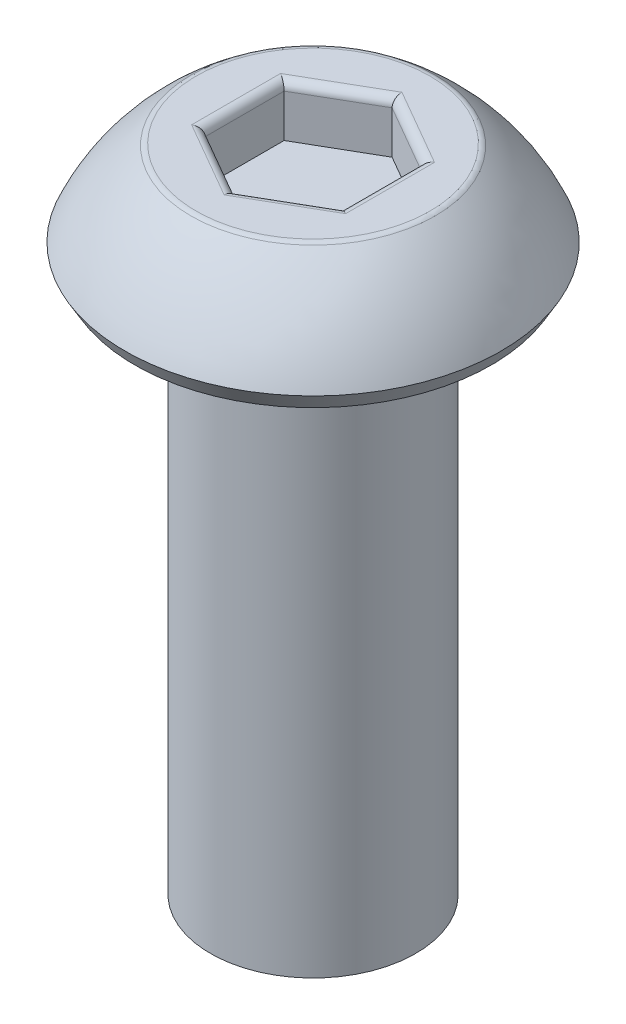
ISO-10303-21;
HEADER;
FILE_DESCRIPTION(('STEP AP214'),'2;1');
FILE_NAME('part.step','',(''),(''),'','','');
FILE_SCHEMA(('AUTOMOTIVE_DESIGN { 1 0 10303 214 1 1 1 1 }'));
ENDSEC;
DATA;
#1=APPLICATION_CONTEXT('core data for automotive mechanical design processes');
#2=APPLICATION_PROTOCOL_DEFINITION('international standard','automotive_design',2000,#1);
#3=PRODUCT_CONTEXT('',#1,'mechanical');
#4=PRODUCT('Part','Part','',(#3));
#5=PRODUCT_RELATED_PRODUCT_CATEGORY('part','',(#4));
#6=PRODUCT_DEFINITION_FORMATION('','',#4);
#7=PRODUCT_DEFINITION_CONTEXT('part definition',#1,'design');
#8=PRODUCT_DEFINITION('design','',#6,#7);
#9=PRODUCT_DEFINITION_SHAPE('','',#8);
#10=(LENGTH_UNIT() NAMED_UNIT(*) SI_UNIT(.MILLI.,.METRE.));
#11=(NAMED_UNIT(*) PLANE_ANGLE_UNIT() SI_UNIT($,.RADIAN.));
#12=(NAMED_UNIT(*) SI_UNIT($,.STERADIAN.) SOLID_ANGLE_UNIT());
#13=UNCERTAINTY_MEASURE_WITH_UNIT(LENGTH_MEASURE(1.E-05),#10,'distance_accuracy_value','');
#14=(GEOMETRIC_REPRESENTATION_CONTEXT(3) GLOBAL_UNCERTAINTY_ASSIGNED_CONTEXT((#13)) GLOBAL_UNIT_ASSIGNED_CONTEXT((#10,
#11,#12)) REPRESENTATION_CONTEXT('',''));
#15=CARTESIAN_POINT('',(0.,0.,0.));
#16=DIRECTION('',(0.,0.,1.));
#17=DIRECTION('',(1.,0.,0.));
#18=AXIS2_PLACEMENT_3D('',#15,#16,#17);
#19=CARTESIAN_POINT('',(0.,1.5,0.));
#20=DIRECTION('',(0.,-1.,0.));
#21=DIRECTION('',(0.,0.,-1.));
#22=AXIS2_PLACEMENT_3D('',#19,#20,#21);
#23=PLANE('',#22);
#24=CARTESIAN_POINT('',(0.,1.5,0.));
#25=DIRECTION('',(0.,-1.,0.));
#26=DIRECTION('',(0.,0.,-1.));
#27=AXIS2_PLACEMENT_3D('',#24,#25,#26);
#28=CIRCLE('',#27,1.70906948191647);
#29=CARTESIAN_POINT('',(0.,1.5,-1.70906948191647));
#30=VERTEX_POINT('',#29);
#31=EDGE_CURVE('E178',#30,#30,#28,.F.);
#32=ORIENTED_EDGE('',*,*,#31,.T.);
#33=EDGE_LOOP('',(#32));
#34=FACE_BOUND('',#33,.T.);
#35=DIRECTION('',(0.866025403784439,0.,-0.5));
#36=VECTOR('',#35,1.);
#37=CARTESIAN_POINT('',(0.5625,1.5,0.974278579257493));
#38=LINE('',#37,#36);
#39=CARTESIAN_POINT('',(1.125,1.5,0.649519052838329));
#40=VERTEX_POINT('',#39);
#41=CARTESIAN_POINT('',(0.,1.5,1.29903810567666));
#42=VERTEX_POINT('',#41);
#43=EDGE_CURVE('E173',#40,#42,#38,.F.);
#44=ORIENTED_EDGE('',*,*,#43,.T.);
#45=DIRECTION('',(0.866025403784439,0.,0.5));
#46=VECTOR('',#45,1.);
#47=CARTESIAN_POINT('',(-0.5625,1.5,0.974278579257493));
#48=LINE('',#47,#46);
#49=CARTESIAN_POINT('',(-1.125,1.5,0.649519052838329));
#50=VERTEX_POINT('',#49);
#51=EDGE_CURVE('E175',#42,#50,#48,.F.);
#52=ORIENTED_EDGE('',*,*,#51,.T.);
#53=DIRECTION('',(0.,0.,1.));
#54=VECTOR('',#53,1.);
#55=CARTESIAN_POINT('',(-1.125,1.5,0.));
#56=LINE('',#55,#54);
#57=CARTESIAN_POINT('',(-1.125,1.5,-0.649519052838329));
#58=VERTEX_POINT('',#57);
#59=EDGE_CURVE('E165',#50,#58,#56,.F.);
#60=ORIENTED_EDGE('',*,*,#59,.T.);
#61=DIRECTION('',(-0.866025403784439,0.,0.5));
#62=VECTOR('',#61,1.);
#63=CARTESIAN_POINT('',(-0.5625,1.5,-0.974278579257493));
#64=LINE('',#63,#62);
#65=CARTESIAN_POINT('',(0.,1.5,-1.29903810567666));
#66=VERTEX_POINT('',#65);
#67=EDGE_CURVE('E167',#58,#66,#64,.F.);
#68=ORIENTED_EDGE('',*,*,#67,.T.);
#69=DIRECTION('',(-0.866025403784439,0.,-0.5));
#70=VECTOR('',#69,1.);
#71=CARTESIAN_POINT('',(0.5625,1.5,-0.974278579257494));
#72=LINE('',#71,#70);
#73=CARTESIAN_POINT('',(1.125,1.5,-0.64951905283833));
#74=VERTEX_POINT('',#73);
#75=EDGE_CURVE('E169',#66,#74,#72,.F.);
#76=ORIENTED_EDGE('',*,*,#75,.T.);
#77=DIRECTION('',(0.,0.,-1.));
#78=VECTOR('',#77,1.);
#79=CARTESIAN_POINT('',(1.125,1.5,0.));
#80=LINE('',#79,#78);
#81=EDGE_CURVE('E171',#74,#40,#80,.F.);
#82=ORIENTED_EDGE('',*,*,#81,.T.);
#83=EDGE_LOOP('',(#44,#52,#60,#68,#76,#82));
#84=FACE_BOUND('',#83,.T.);
#85=ADVANCED_FACE('F36',(#34,#84),#23,.F.);
#86=CARTESIAN_POINT('',(0.,-0.931154789034212,0.));
#87=DIRECTION('',(0.,-1.,0.));
#88=DIRECTION('',(0.,0.,-1.));
#89=AXIS2_PLACEMENT_3D('',#86,#87,#88);
#90=DEGENERATE_TOROIDAL_SURFACE('',#89,0.00769348629276519,3.,.F.);
#91=CARTESIAN_POINT('',(0.,1.47526759952323,0.));
#92=DIRECTION('',(0.,-1.,0.));
#93=DIRECTION('',(0.,0.,-1.));
#94=AXIS2_PLACEMENT_3D('',#91,#92,#93);
#95=CIRCLE('',#94,1.78371135009948);
#96=CARTESIAN_POINT('',(0.,1.47526759952323,-1.78371135009948));
#97=VERTEX_POINT('',#96);
#98=EDGE_CURVE('E162',#97,#97,#95,.T.);
#99=ORIENTED_EDGE('',*,*,#98,.T.);
#100=EDGE_LOOP('',(#99));
#101=FACE_BOUND('',#100,.T.);
#102=CARTESIAN_POINT('',(0.,0.25,0.));
#103=DIRECTION('',(0.,-1.,0.));
#104=DIRECTION('',(0.,0.,-1.));
#105=AXIS2_PLACEMENT_3D('',#102,#103,#104);
#106=CIRCLE('',#105,2.75);
#107=CARTESIAN_POINT('',(0.,0.25,-2.75));
#108=VERTEX_POINT('',#107);
#109=EDGE_CURVE('E159',#108,#108,#106,.T.);
#110=ORIENTED_EDGE('',*,*,#109,.F.);
#111=EDGE_LOOP('',(#110));
#112=FACE_BOUND('',#111,.T.);
#113=ADVANCED_FACE('F245',(#101,#112),#90,.F.);
#114=CARTESIAN_POINT('',(0.,0.25,0.));
#115=DIRECTION('',(0.,1.,0.));
#116=DIRECTION('',(0.,0.,1.));
#117=AXIS2_PLACEMENT_3D('',#114,#115,#116);
#118=CONICAL_SURFACE('',#117,2.75,0.523598775598296);
#119=CARTESIAN_POINT('',(0.,0.,0.));
#120=DIRECTION('',(0.,-1.,0.));
#121=DIRECTION('',(0.,0.,-1.));
#122=AXIS2_PLACEMENT_3D('',#119,#120,#121);
#123=CIRCLE('',#122,2.60566243270259);
#124=CARTESIAN_POINT('',(0.,0.,-2.60566243270259));
#125=VERTEX_POINT('',#124);
#126=EDGE_CURVE('E156',#125,#125,#123,.T.);
#127=ORIENTED_EDGE('',*,*,#126,.F.);
#128=EDGE_LOOP('',(#127));
#129=FACE_BOUND('',#128,.T.);
#130=ORIENTED_EDGE('',*,*,#109,.T.);
#131=EDGE_LOOP('',(#130));
#132=FACE_BOUND('',#131,.T.);
#133=ADVANCED_FACE('F251',(#129,#132),#118,.T.);
#134=CARTESIAN_POINT('',(0.,0.,2.60566243270259));
#135=DIRECTION('',(0.,1.,0.));
#136=DIRECTION('',(0.,0.,1.));
#137=AXIS2_PLACEMENT_3D('',#134,#135,#136);
#138=PLANE('',#137);
#139=CARTESIAN_POINT('',(0.,0.,0.));
#140=DIRECTION('',(0.,-1.,0.));
#141=DIRECTION('',(0.,0.,-1.));
#142=AXIS2_PLACEMENT_3D('',#139,#140,#141);
#143=CIRCLE('',#142,1.5);
#144=CARTESIAN_POINT('',(0.,0.,-1.5));
#145=VERTEX_POINT('',#144);
#146=EDGE_CURVE('E153',#145,#145,#143,.T.);
#147=ORIENTED_EDGE('',*,*,#146,.F.);
#148=EDGE_LOOP('',(#147));
#149=FACE_BOUND('',#148,.T.);
#150=ORIENTED_EDGE('',*,*,#126,.T.);
#151=EDGE_LOOP('',(#150));
#152=FACE_BOUND('',#151,.T.);
#153=ADVANCED_FACE('F270',(#149,#152),#138,.F.);
#154=CARTESIAN_POINT('',(0.,-8.,0.));
#155=DIRECTION('',(0.,-1.,0.));
#156=DIRECTION('',(0.,0.,-1.));
#157=AXIS2_PLACEMENT_3D('',#154,#155,#156);
#158=CYLINDRICAL_SURFACE('',#157,1.5);
#159=CARTESIAN_POINT('',(0.,-8.,0.));
#160=DIRECTION('',(0.,-1.,0.));
#161=DIRECTION('',(0.,0.,-1.));
#162=AXIS2_PLACEMENT_3D('',#159,#160,#161);
#163=CIRCLE('',#162,1.5);
#164=CARTESIAN_POINT('',(0.,-8.,-1.5));
#165=VERTEX_POINT('',#164);
#166=EDGE_CURVE('E140',#165,#165,#163,.T.);
#167=ORIENTED_EDGE('',*,*,#166,.F.);
#168=EDGE_LOOP('',(#167));
#169=FACE_BOUND('',#168,.T.);
#170=ORIENTED_EDGE('',*,*,#146,.T.);
#171=EDGE_LOOP('',(#170));
#172=FACE_BOUND('',#171,.T.);
#173=ADVANCED_FACE('F275',(#169,#172),#158,.T.);
#174=CARTESIAN_POINT('',(0.,-8.,1.5));
#175=DIRECTION('',(0.,1.,0.));
#176=DIRECTION('',(0.,0.,1.));
#177=AXIS2_PLACEMENT_3D('',#174,#175,#176);
#178=PLANE('',#177);
#179=ORIENTED_EDGE('',*,*,#166,.T.);
#180=EDGE_LOOP('',(#179));
#181=FACE_BOUND('',#180,.T.);
#182=ADVANCED_FACE('F282',(#181),#178,.F.);
#183=CARTESIAN_POINT('',(0.999999999999999,0.75,-0.577350269189626));
#184=DIRECTION('',(0.5,0.,-0.866025403784439));
#185=DIRECTION('',(-0.866025403784439,0.,-0.5));
#186=AXIS2_PLACEMENT_3D('',#183,#184,#185);
#187=PLANE('',#186);
#188=DIRECTION('',(0.,1.,0.));
#189=VECTOR('',#188,1.);
#190=CARTESIAN_POINT('',(0.999999999999999,0.75,-0.577350269189626));
#191=LINE('',#190,#189);
#192=CARTESIAN_POINT('',(0.999999999999999,0.75,-0.577350269189626));
#193=VERTEX_POINT('',#192);
#194=CARTESIAN_POINT('',(0.999999999999999,1.375,-0.577350269189626));
#195=VERTEX_POINT('',#194);
#196=EDGE_CURVE('E138',#193,#195,#191,.T.);
#197=ORIENTED_EDGE('',*,*,#196,.T.);
#198=DIRECTION('',(-0.866025403784439,0.,-0.5));
#199=VECTOR('',#198,1.);
#200=CARTESIAN_POINT('',(0.999999999999999,1.375,-0.577350269189626));
#201=LINE('',#200,#199);
#202=CARTESIAN_POINT('',(0.,1.375,-1.15470053837925));
#203=VERTEX_POINT('',#202);
#204=EDGE_CURVE('E60',#195,#203,#201,.T.);
#205=ORIENTED_EDGE('',*,*,#204,.T.);
#206=DIRECTION('',(0.,1.,0.));
#207=VECTOR('',#206,1.);
#208=CARTESIAN_POINT('',(0.,0.75,-1.15470053837925));
#209=LINE('',#208,#207);
#210=CARTESIAN_POINT('',(0.,0.75,-1.15470053837925));
#211=VERTEX_POINT('',#210);
#212=EDGE_CURVE('E106',#211,#203,#209,.T.);
#213=ORIENTED_EDGE('',*,*,#212,.F.);
#214=DIRECTION('',(-0.866025403784439,0.,-0.5));
#215=VECTOR('',#214,1.);
#216=CARTESIAN_POINT('',(0.999999999999999,0.75,-0.577350269189626));
#217=LINE('',#216,#215);
#218=EDGE_CURVE('E110',#193,#211,#217,.T.);
#219=ORIENTED_EDGE('',*,*,#218,.F.);
#220=EDGE_LOOP('',(#197,#205,#213,#219));
#221=FACE_BOUND('',#220,.T.);
#222=ADVANCED_FACE('F108',(#221),#187,.F.);
#223=CARTESIAN_POINT('',(1.,0.75,0.577350269189626));
#224=DIRECTION('',(1.,0.,0.));
#225=DIRECTION('',(0.,0.,-1.));
#226=AXIS2_PLACEMENT_3D('',#223,#224,#225);
#227=PLANE('',#226);
#228=DIRECTION('',(0.,1.,0.));
#229=VECTOR('',#228,1.);
#230=CARTESIAN_POINT('',(1.,0.75,0.577350269189626));
#231=LINE('',#230,#229);
#232=CARTESIAN_POINT('',(1.,0.75,0.577350269189626));
#233=VERTEX_POINT('',#232);
#234=CARTESIAN_POINT('',(1.,1.375,0.577350269189626));
#235=VERTEX_POINT('',#234);
#236=EDGE_CURVE('E141',#233,#235,#231,.T.);
#237=ORIENTED_EDGE('',*,*,#236,.T.);
#238=DIRECTION('',(0.,0.,-1.));
#239=VECTOR('',#238,1.);
#240=CARTESIAN_POINT('',(1.,1.375,0.577350269189626));
#241=LINE('',#240,#239);
#242=EDGE_CURVE('E186',#235,#195,#241,.T.);
#243=ORIENTED_EDGE('',*,*,#242,.T.);
#244=ORIENTED_EDGE('',*,*,#196,.F.);
#245=DIRECTION('',(0.,0.,-1.));
#246=VECTOR('',#245,1.);
#247=CARTESIAN_POINT('',(1.,0.75,0.577350269189626));
#248=LINE('',#247,#246);
#249=EDGE_CURVE('E114',#233,#193,#248,.T.);
#250=ORIENTED_EDGE('',*,*,#249,.F.);
#251=EDGE_LOOP('',(#237,#243,#244,#250));
#252=FACE_BOUND('',#251,.T.);
#253=ADVANCED_FACE('F226',(#252),#227,.F.);
#254=CARTESIAN_POINT('',(0.,0.75,1.15470053837925));
#255=DIRECTION('',(0.5,0.,0.866025403784439));
#256=DIRECTION('',(0.866025403784439,0.,-0.5));
#257=AXIS2_PLACEMENT_3D('',#254,#255,#256);
#258=PLANE('',#257);
#259=DIRECTION('',(0.,1.,0.));
#260=VECTOR('',#259,1.);
#261=CARTESIAN_POINT('',(0.,0.75,1.15470053837925));
#262=LINE('',#261,#260);
#263=CARTESIAN_POINT('',(0.,0.75,1.15470053837925));
#264=VERTEX_POINT('',#263);
#265=CARTESIAN_POINT('',(0.,1.375,1.15470053837925));
#266=VERTEX_POINT('',#265);
#267=EDGE_CURVE('E144',#264,#266,#262,.T.);
#268=ORIENTED_EDGE('',*,*,#267,.T.);
#269=DIRECTION('',(0.866025403784439,0.,-0.5));
#270=VECTOR('',#269,1.);
#271=CARTESIAN_POINT('',(0.,1.375,1.15470053837925));
#272=LINE('',#271,#270);
#273=EDGE_CURVE('E184',#266,#235,#272,.T.);
#274=ORIENTED_EDGE('',*,*,#273,.T.);
#275=ORIENTED_EDGE('',*,*,#236,.F.);
#276=DIRECTION('',(0.866025403784439,0.,-0.5));
#277=VECTOR('',#276,1.);
#278=CARTESIAN_POINT('',(0.,0.75,1.15470053837925));
#279=LINE('',#278,#277);
#280=EDGE_CURVE('E135',#264,#233,#279,.T.);
#281=ORIENTED_EDGE('',*,*,#280,.F.);
#282=EDGE_LOOP('',(#268,#274,#275,#281));
#283=FACE_BOUND('',#282,.T.);
#284=ADVANCED_FACE('F227',(#283),#258,.F.);
#285=CARTESIAN_POINT('',(-0.999999999999999,0.75,0.577350269189626));
#286=DIRECTION('',(-0.5,0.,0.866025403784439));
#287=DIRECTION('',(0.866025403784439,0.,0.5));
#288=AXIS2_PLACEMENT_3D('',#285,#286,#287);
#289=PLANE('',#288);
#290=DIRECTION('',(0.,1.,0.));
#291=VECTOR('',#290,1.);
#292=CARTESIAN_POINT('',(-0.999999999999999,0.75,0.577350269189626));
#293=LINE('',#292,#291);
#294=CARTESIAN_POINT('',(-0.999999999999999,0.75,0.577350269189626));
#295=VERTEX_POINT('',#294);
#296=CARTESIAN_POINT('',(-0.999999999999999,1.375,0.577350269189626));
#297=VERTEX_POINT('',#296);
#298=EDGE_CURVE('E147',#295,#297,#293,.T.);
#299=ORIENTED_EDGE('',*,*,#298,.T.);
#300=DIRECTION('',(0.866025403784439,0.,0.5));
#301=VECTOR('',#300,1.);
#302=CARTESIAN_POINT('',(-0.999999999999999,1.375,0.577350269189626));
#303=LINE('',#302,#301);
#304=EDGE_CURVE('E181',#297,#266,#303,.T.);
#305=ORIENTED_EDGE('',*,*,#304,.T.);
#306=ORIENTED_EDGE('',*,*,#267,.F.);
#307=DIRECTION('',(0.866025403784439,0.,0.5));
#308=VECTOR('',#307,1.);
#309=CARTESIAN_POINT('',(-0.999999999999999,0.75,0.577350269189626));
#310=LINE('',#309,#308);
#311=EDGE_CURVE('E132',#295,#264,#310,.T.);
#312=ORIENTED_EDGE('',*,*,#311,.F.);
#313=EDGE_LOOP('',(#299,#305,#306,#312));
#314=FACE_BOUND('',#313,.T.);
#315=ADVANCED_FACE('F222',(#314),#289,.F.);
#316=CARTESIAN_POINT('',(-1.,0.75,-0.577350269189626));
#317=DIRECTION('',(-1.,0.,0.));
#318=DIRECTION('',(0.,0.,1.));
#319=AXIS2_PLACEMENT_3D('',#316,#317,#318);
#320=PLANE('',#319);
#321=DIRECTION('',(0.,1.,0.));
#322=VECTOR('',#321,1.);
#323=CARTESIAN_POINT('',(-1.,0.75,-0.577350269189626));
#324=LINE('',#323,#322);
#325=CARTESIAN_POINT('',(-1.,0.75,-0.577350269189626));
#326=VERTEX_POINT('',#325);
#327=CARTESIAN_POINT('',(-1.,1.375,-0.577350269189626));
#328=VERTEX_POINT('',#327);
#329=EDGE_CURVE('E113',#326,#328,#324,.T.);
#330=ORIENTED_EDGE('',*,*,#329,.T.);
#331=DIRECTION('',(0.,0.,1.));
#332=VECTOR('',#331,1.);
#333=CARTESIAN_POINT('',(-1.,1.375,-0.577350269189626));
#334=LINE('',#333,#332);
#335=EDGE_CURVE('E11',#328,#297,#334,.T.);
#336=ORIENTED_EDGE('',*,*,#335,.T.);
#337=ORIENTED_EDGE('',*,*,#298,.F.);
#338=DIRECTION('',(0.,0.,1.));
#339=VECTOR('',#338,1.);
#340=CARTESIAN_POINT('',(-1.,0.75,-0.577350269189626));
#341=LINE('',#340,#339);
#342=EDGE_CURVE('E122',#326,#295,#341,.T.);
#343=ORIENTED_EDGE('',*,*,#342,.F.);
#344=EDGE_LOOP('',(#330,#336,#337,#343));
#345=FACE_BOUND('',#344,.T.);
#346=ADVANCED_FACE('F219',(#345),#320,.F.);
#347=CARTESIAN_POINT('',(0.,0.75,-1.15470053837925));
#348=DIRECTION('',(-0.5,0.,-0.866025403784438));
#349=DIRECTION('',(-0.866025403784439,0.,0.5));
#350=AXIS2_PLACEMENT_3D('',#347,#348,#349);
#351=PLANE('',#350);
#352=ORIENTED_EDGE('',*,*,#212,.T.);
#353=DIRECTION('',(-0.866025403784439,0.,0.5));
#354=VECTOR('',#353,1.);
#355=CARTESIAN_POINT('',(0.,1.375,-1.15470053837925));
#356=LINE('',#355,#354);
#357=EDGE_CURVE('E45',#203,#328,#356,.T.);
#358=ORIENTED_EDGE('',*,*,#357,.T.);
#359=ORIENTED_EDGE('',*,*,#329,.F.);
#360=DIRECTION('',(-0.866025403784439,0.,0.5));
#361=VECTOR('',#360,1.);
#362=CARTESIAN_POINT('',(0.,0.75,-1.15470053837925));
#363=LINE('',#362,#361);
#364=EDGE_CURVE('E117',#211,#326,#363,.T.);
#365=ORIENTED_EDGE('',*,*,#364,.F.);
#366=EDGE_LOOP('',(#352,#358,#359,#365));
#367=FACE_BOUND('',#366,.T.);
#368=ADVANCED_FACE('F118',(#367),#351,.F.);
#369=CARTESIAN_POINT('',(0.,0.75,0.));
#370=DIRECTION('',(0.,1.,0.));
#371=DIRECTION('',(0.,0.,1.));
#372=AXIS2_PLACEMENT_3D('',#369,#370,#371);
#373=PLANE('',#372);
#374=ORIENTED_EDGE('',*,*,#218,.T.);
#375=ORIENTED_EDGE('',*,*,#364,.T.);
#376=ORIENTED_EDGE('',*,*,#342,.T.);
#377=ORIENTED_EDGE('',*,*,#311,.T.);
#378=ORIENTED_EDGE('',*,*,#280,.T.);
#379=ORIENTED_EDGE('',*,*,#249,.T.);
#380=EDGE_LOOP('',(#374,#375,#376,#377,#378,#379));
#381=FACE_BOUND('',#380,.T.);
#382=ADVANCED_FACE('F124',(#381),#373,.T.);
#383=CARTESIAN_POINT('',(0.,1.375,0.));
#384=DIRECTION('',(0.,-1.,0.));
#385=DIRECTION('',(0.,0.,-1.));
#386=AXIS2_PLACEMENT_3D('',#383,#384,#385);
#387=TOROIDAL_SURFACE('',#386,1.70906948191647,0.125);
#388=ORIENTED_EDGE('',*,*,#31,.F.);
#389=EDGE_LOOP('',(#388));
#390=FACE_BOUND('',#389,.T.);
#391=ORIENTED_EDGE('',*,*,#98,.F.);
#392=EDGE_LOOP('',(#391));
#393=FACE_BOUND('',#392,.T.);
#394=ADVANCED_FACE('F255',(#390,#393),#387,.T.);
#395=CARTESIAN_POINT('',(1.0625,1.375,-0.685603444662681));
#396=DIRECTION('',(-0.866025403784439,0.,-0.5));
#397=DIRECTION('',(-0.5,0.,0.866025403784439));
#398=AXIS2_PLACEMENT_3D('',#395,#396,#397);
#399=CYLINDRICAL_SURFACE('',#398,0.125);
#400=CARTESIAN_POINT('',(1.125,1.375,-0.64951905283833));
#401=DIRECTION('',(-0.5,0.,-0.866025403784438));
#402=DIRECTION('',(0.866025403784439,0.,-0.5));
#403=AXIS2_PLACEMENT_3D('',#400,#401,#402);
#404=ELLIPSE('',#403,0.144337567297406,0.125);
#405=EDGE_CURVE('E129',#74,#195,#404,.F.);
#406=ORIENTED_EDGE('',*,*,#405,.F.);
#407=ORIENTED_EDGE('',*,*,#75,.F.);
#408=CARTESIAN_POINT('',(0.,1.375,-1.29903810567666));
#409=DIRECTION('',(-1.,0.,0.));
#410=DIRECTION('',(0.,0.,-1.));
#411=AXIS2_PLACEMENT_3D('',#408,#409,#410);
#412=ELLIPSE('',#411,0.144337567297406,0.125);
#413=EDGE_CURVE('E40',#203,#66,#412,.T.);
#414=ORIENTED_EDGE('',*,*,#413,.F.);
#415=ORIENTED_EDGE('',*,*,#204,.F.);
#416=EDGE_LOOP('',(#406,#407,#414,#415));
#417=FACE_BOUND('',#416,.T.);
#418=ADVANCED_FACE('F38',(#417),#399,.T.);
#419=CARTESIAN_POINT('',(-0.0625000000000002,1.375,-1.26295371385231));
#420=DIRECTION('',(-0.866025403784439,0.,0.5));
#421=DIRECTION('',(0.5,0.,0.866025403784439));
#422=AXIS2_PLACEMENT_3D('',#419,#420,#421);
#423=CYLINDRICAL_SURFACE('',#422,0.125);
#424=ORIENTED_EDGE('',*,*,#413,.T.);
#425=ORIENTED_EDGE('',*,*,#67,.F.);
#426=CARTESIAN_POINT('',(-1.125,1.375,-0.649519052838329));
#427=DIRECTION('',(-0.5,0.,0.866025403784439));
#428=DIRECTION('',(-0.866025403784439,0.,-0.5));
#429=AXIS2_PLACEMENT_3D('',#426,#427,#428);
#430=ELLIPSE('',#429,0.144337567297406,0.125);
#431=EDGE_CURVE('E197',#328,#58,#430,.T.);
#432=ORIENTED_EDGE('',*,*,#431,.F.);
#433=ORIENTED_EDGE('',*,*,#357,.F.);
#434=EDGE_LOOP('',(#424,#425,#432,#433));
#435=FACE_BOUND('',#434,.T.);
#436=ADVANCED_FACE('F211',(#435),#423,.T.);
#437=CARTESIAN_POINT('',(1.125,1.375,0.577350269189626));
#438=DIRECTION('',(0.,0.,-1.));
#439=DIRECTION('',(-1.,0.,0.));
#440=AXIS2_PLACEMENT_3D('',#437,#438,#439);
#441=CYLINDRICAL_SURFACE('',#440,0.125);
#442=ORIENTED_EDGE('',*,*,#405,.T.);
#443=ORIENTED_EDGE('',*,*,#242,.F.);
#444=CARTESIAN_POINT('',(1.125,1.375,0.649519052838329));
#445=DIRECTION('',(0.5,0.,-0.866025403784439));
#446=DIRECTION('',(0.866025403784439,0.,0.5));
#447=AXIS2_PLACEMENT_3D('',#444,#445,#446);
#448=ELLIPSE('',#447,0.144337567297406,0.125);
#449=EDGE_CURVE('E194',#40,#235,#448,.F.);
#450=ORIENTED_EDGE('',*,*,#449,.F.);
#451=ORIENTED_EDGE('',*,*,#81,.F.);
#452=EDGE_LOOP('',(#442,#443,#450,#451));
#453=FACE_BOUND('',#452,.T.);
#454=ADVANCED_FACE('F204',(#453),#441,.T.);
#455=CARTESIAN_POINT('',(-1.125,1.375,-0.577350269189626));
#456=DIRECTION('',(0.,0.,1.));
#457=DIRECTION('',(1.,0.,0.));
#458=AXIS2_PLACEMENT_3D('',#455,#456,#457);
#459=CYLINDRICAL_SURFACE('',#458,0.125);
#460=ORIENTED_EDGE('',*,*,#431,.T.);
#461=ORIENTED_EDGE('',*,*,#59,.F.);
#462=CARTESIAN_POINT('',(-1.125,1.375,0.649519052838329));
#463=DIRECTION('',(0.5,0.,0.866025403784438));
#464=DIRECTION('',(0.866025403784439,0.,-0.5));
#465=AXIS2_PLACEMENT_3D('',#462,#463,#464);
#466=ELLIPSE('',#465,0.144337567297406,0.125);
#467=EDGE_CURVE('E192',#297,#50,#466,.T.);
#468=ORIENTED_EDGE('',*,*,#467,.F.);
#469=ORIENTED_EDGE('',*,*,#335,.F.);
#470=EDGE_LOOP('',(#460,#461,#468,#469));
#471=FACE_BOUND('',#470,.T.);
#472=ADVANCED_FACE('F216',(#471),#459,.T.);
#473=CARTESIAN_POINT('',(0.0625000000000004,1.375,1.26295371385231));
#474=DIRECTION('',(0.866025403784439,0.,-0.5));
#475=DIRECTION('',(-0.5,0.,-0.866025403784439));
#476=AXIS2_PLACEMENT_3D('',#473,#474,#475);
#477=CYLINDRICAL_SURFACE('',#476,0.125);
#478=ORIENTED_EDGE('',*,*,#449,.T.);
#479=ORIENTED_EDGE('',*,*,#273,.F.);
#480=CARTESIAN_POINT('',(0.,1.375,1.29903810567666));
#481=DIRECTION('',(1.,0.,0.));
#482=DIRECTION('',(0.,0.,1.));
#483=AXIS2_PLACEMENT_3D('',#480,#481,#482);
#484=ELLIPSE('',#483,0.144337567297406,0.125);
#485=EDGE_CURVE('E190',#42,#266,#484,.F.);
#486=ORIENTED_EDGE('',*,*,#485,.F.);
#487=ORIENTED_EDGE('',*,*,#43,.F.);
#488=EDGE_LOOP('',(#478,#479,#486,#487));
#489=FACE_BOUND('',#488,.T.);
#490=ADVANCED_FACE('F231',(#489),#477,.T.);
#491=CARTESIAN_POINT('',(-1.0625,1.375,0.685603444662681));
#492=DIRECTION('',(0.866025403784439,0.,0.5));
#493=DIRECTION('',(0.5,0.,-0.866025403784439));
#494=AXIS2_PLACEMENT_3D('',#491,#492,#493);
#495=CYLINDRICAL_SURFACE('',#494,0.125);
#496=ORIENTED_EDGE('',*,*,#467,.T.);
#497=ORIENTED_EDGE('',*,*,#51,.F.);
#498=ORIENTED_EDGE('',*,*,#485,.T.);
#499=ORIENTED_EDGE('',*,*,#304,.F.);
#500=EDGE_LOOP('',(#496,#497,#498,#499));
#501=FACE_BOUND('',#500,.T.);
#502=ADVANCED_FACE('F236',(#501),#495,.T.);
#503=CLOSED_SHELL('',(#85,#113,#133,#153,#173,#182,#222,#253,#284,#315,#346,#368,#382,#394,#418,
#436,#454,#472,#490,#502));
#504=MANIFOLD_SOLID_BREP('B2',#503);
#505=ADVANCED_BREP_SHAPE_REPRESENTATION('',(#18,#504),#14);
#506=SHAPE_DEFINITION_REPRESENTATION(#9,#505);
ENDSEC;
END-ISO-10303-21;
